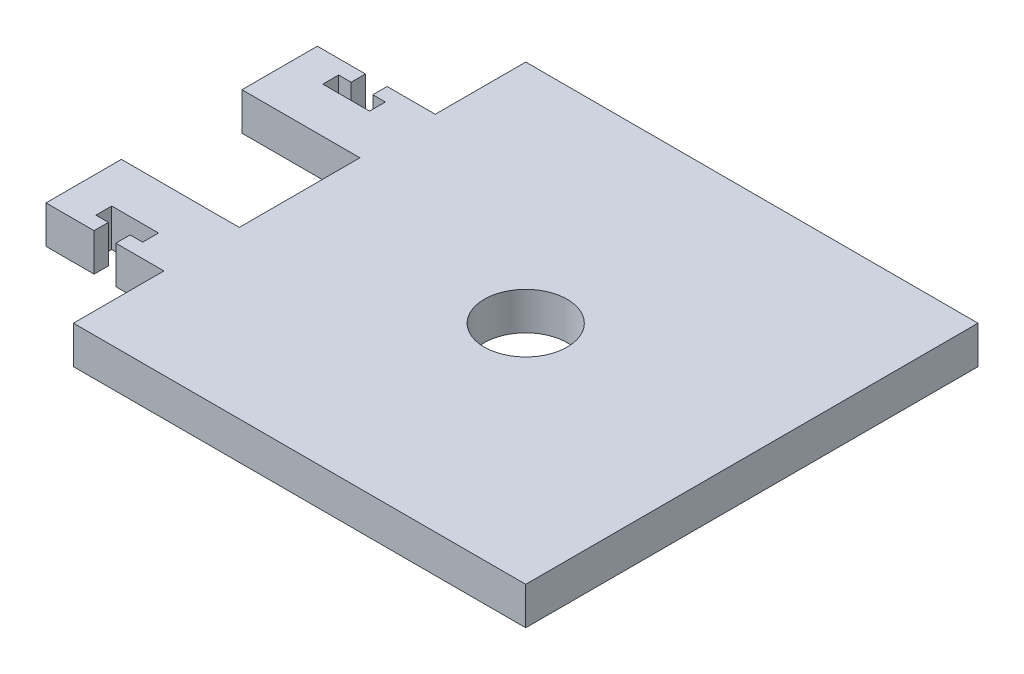
ISO-10303-21;
HEADER;
FILE_DESCRIPTION(('STEP AP214'),'2;1');
FILE_NAME('part.step','',(''),(''),'','','');
FILE_SCHEMA(('AUTOMOTIVE_DESIGN { 1 0 10303 214 1 1 1 1 }'));
ENDSEC;
DATA;
#1=APPLICATION_CONTEXT('core data for automotive mechanical design processes');
#2=APPLICATION_PROTOCOL_DEFINITION('international standard','automotive_design',2000,#1);
#3=PRODUCT_CONTEXT('',#1,'mechanical');
#4=PRODUCT('Part','Part','',(#3));
#5=PRODUCT_RELATED_PRODUCT_CATEGORY('part','',(#4));
#6=PRODUCT_DEFINITION_FORMATION('','',#4);
#7=PRODUCT_DEFINITION_CONTEXT('part definition',#1,'design');
#8=PRODUCT_DEFINITION('design','',#6,#7);
#9=PRODUCT_DEFINITION_SHAPE('','',#8);
#10=(LENGTH_UNIT() NAMED_UNIT(*) SI_UNIT(.MILLI.,.METRE.));
#11=(NAMED_UNIT(*) PLANE_ANGLE_UNIT() SI_UNIT($,.RADIAN.));
#12=(NAMED_UNIT(*) SI_UNIT($,.STERADIAN.) SOLID_ANGLE_UNIT());
#13=UNCERTAINTY_MEASURE_WITH_UNIT(LENGTH_MEASURE(1.E-05),#10,'distance_accuracy_value','');
#14=(GEOMETRIC_REPRESENTATION_CONTEXT(3) GLOBAL_UNCERTAINTY_ASSIGNED_CONTEXT((#13)) GLOBAL_UNIT_ASSIGNED_CONTEXT((#10,
#11,#12)) REPRESENTATION_CONTEXT('',''));
#15=CARTESIAN_POINT('',(0.,0.,0.));
#16=DIRECTION('',(0.,0.,1.));
#17=DIRECTION('',(1.,0.,0.));
#18=AXIS2_PLACEMENT_3D('',#15,#16,#17);
#19=CARTESIAN_POINT('',(38.1000000000002,-6.35,38.1000000000002));
#20=DIRECTION('',(1.,0.,0.));
#21=DIRECTION('',(0.,0.,-1.));
#22=AXIS2_PLACEMENT_3D('',#19,#20,#21);
#23=PLANE('',#22);
#24=DIRECTION('',(0.,0.,-1.));
#25=VECTOR('',#24,1.);
#26=CARTESIAN_POINT('',(38.1000000000002,0.,38.1000000000002));
#27=LINE('',#26,#25);
#28=CARTESIAN_POINT('',(38.1000000000002,0.,38.1000000000002));
#29=VERTEX_POINT('',#28);
#30=CARTESIAN_POINT('',(38.1000000000002,0.,-38.1000000000002));
#31=VERTEX_POINT('',#30);
#32=EDGE_CURVE('E250',#29,#31,#27,.T.);
#33=ORIENTED_EDGE('',*,*,#32,.F.);
#34=DIRECTION('',(0.,1.,0.));
#35=VECTOR('',#34,1.);
#36=CARTESIAN_POINT('',(38.1000000000002,-6.35,38.1000000000002));
#37=LINE('',#36,#35);
#38=CARTESIAN_POINT('',(38.1000000000002,-6.35,38.1000000000002));
#39=VERTEX_POINT('',#38);
#40=EDGE_CURVE('E11',#39,#29,#37,.T.);
#41=ORIENTED_EDGE('',*,*,#40,.F.);
#42=DIRECTION('',(0.,0.,-1.));
#43=VECTOR('',#42,1.);
#44=CARTESIAN_POINT('',(38.1000000000002,-6.35,38.1000000000002));
#45=LINE('',#44,#43);
#46=CARTESIAN_POINT('',(38.1000000000002,-6.35,-38.1000000000002));
#47=VERTEX_POINT('',#46);
#48=EDGE_CURVE('E331',#39,#47,#45,.T.);
#49=ORIENTED_EDGE('',*,*,#48,.T.);
#50=DIRECTION('',(0.,1.,0.));
#51=VECTOR('',#50,1.);
#52=CARTESIAN_POINT('',(38.1000000000002,-6.35,-38.1000000000002));
#53=LINE('',#52,#51);
#54=EDGE_CURVE('E36',#47,#31,#53,.T.);
#55=ORIENTED_EDGE('',*,*,#54,.T.);
#56=EDGE_LOOP('',(#33,#41,#49,#55));
#57=FACE_BOUND('',#56,.T.);
#58=ADVANCED_FACE('F33',(#57),#23,.T.);
#59=CARTESIAN_POINT('',(-38.0999999999998,-6.35,38.1000000000002));
#60=DIRECTION('',(0.,0.,1.));
#61=DIRECTION('',(1.,0.,0.));
#62=AXIS2_PLACEMENT_3D('',#59,#60,#61);
#63=PLANE('',#62);
#64=DIRECTION('',(1.,0.,0.));
#65=VECTOR('',#64,1.);
#66=CARTESIAN_POINT('',(-38.0999999999998,0.,38.1000000000002));
#67=LINE('',#66,#65);
#68=CARTESIAN_POINT('',(-38.0999999999998,0.,38.1000000000002));
#69=VERTEX_POINT('',#68);
#70=EDGE_CURVE('E329',#69,#29,#67,.T.);
#71=ORIENTED_EDGE('',*,*,#70,.F.);
#72=DIRECTION('',(0.,1.,0.));
#73=VECTOR('',#72,1.);
#74=CARTESIAN_POINT('',(-38.0999999999998,-6.35,38.1000000000002));
#75=LINE('',#74,#73);
#76=CARTESIAN_POINT('',(-38.0999999999998,-6.35,38.1000000000002));
#77=VERTEX_POINT('',#76);
#78=EDGE_CURVE('E42',#77,#69,#75,.T.);
#79=ORIENTED_EDGE('',*,*,#78,.F.);
#80=DIRECTION('',(1.,0.,0.));
#81=VECTOR('',#80,1.);
#82=CARTESIAN_POINT('',(-38.0999999999998,-6.35,38.1000000000002));
#83=LINE('',#82,#81);
#84=EDGE_CURVE('E240',#77,#39,#83,.T.);
#85=ORIENTED_EDGE('',*,*,#84,.T.);
#86=ORIENTED_EDGE('',*,*,#40,.T.);
#87=EDGE_LOOP('',(#71,#79,#85,#86));
#88=FACE_BOUND('',#87,.T.);
#89=ADVANCED_FACE('F383',(#88),#63,.T.);
#90=CARTESIAN_POINT('',(-38.0999999999998,-6.35,38.1000000000002));
#91=DIRECTION('',(-1.,0.,0.));
#92=DIRECTION('',(0.,0.,1.));
#93=AXIS2_PLACEMENT_3D('',#90,#91,#92);
#94=PLANE('',#93);
#95=DIRECTION('',(0.,0.,1.));
#96=VECTOR('',#95,1.);
#97=CARTESIAN_POINT('',(-38.0999999999998,0.,38.1000000000002));
#98=LINE('',#97,#96);
#99=CARTESIAN_POINT('',(-38.0999999999998,0.,22.8600000000002));
#100=VERTEX_POINT('',#99);
#101=EDGE_CURVE('E227',#100,#69,#98,.T.);
#102=ORIENTED_EDGE('',*,*,#101,.F.);
#103=DIRECTION('',(0.,1.,0.));
#104=VECTOR('',#103,1.);
#105=CARTESIAN_POINT('',(-38.0999999999998,-6.35,22.8600000000002));
#106=LINE('',#105,#104);
#107=CARTESIAN_POINT('',(-38.0999999999998,-6.35,22.8600000000002));
#108=VERTEX_POINT('',#107);
#109=EDGE_CURVE('E222',#108,#100,#106,.T.);
#110=ORIENTED_EDGE('',*,*,#109,.F.);
#111=DIRECTION('',(0.,0.,1.));
#112=VECTOR('',#111,1.);
#113=CARTESIAN_POINT('',(-38.0999999999998,-6.35,38.1000000000002));
#114=LINE('',#113,#112);
#115=EDGE_CURVE('E225',#108,#77,#114,.T.);
#116=ORIENTED_EDGE('',*,*,#115,.T.);
#117=ORIENTED_EDGE('',*,*,#78,.T.);
#118=EDGE_LOOP('',(#102,#110,#116,#117));
#119=FACE_BOUND('',#118,.T.);
#120=ADVANCED_FACE('F224',(#119),#94,.T.);
#121=CARTESIAN_POINT('',(-38.0999999999998,-6.35,22.8600000000002));
#122=DIRECTION('',(0.,0.,1.));
#123=DIRECTION('',(1.,0.,0.));
#124=AXIS2_PLACEMENT_3D('',#121,#122,#123);
#125=PLANE('',#124);
#126=DIRECTION('',(1.,0.,0.));
#127=VECTOR('',#126,1.);
#128=CARTESIAN_POINT('',(-38.0999999999998,0.,22.8600000000002));
#129=LINE('',#128,#127);
#130=CARTESIAN_POINT('',(-46.2025999999998,0.,22.8600000000002));
#131=VERTEX_POINT('',#130);
#132=EDGE_CURVE('E326',#131,#100,#129,.T.);
#133=ORIENTED_EDGE('',*,*,#132,.F.);
#134=DIRECTION('',(0.,1.,0.));
#135=VECTOR('',#134,1.);
#136=CARTESIAN_POINT('',(-46.2025999999998,-6.35,22.8600000000002));
#137=LINE('',#136,#135);
#138=CARTESIAN_POINT('',(-46.2025999999998,-6.35,22.8600000000002));
#139=VERTEX_POINT('',#138);
#140=EDGE_CURVE('E232',#139,#131,#137,.T.);
#141=ORIENTED_EDGE('',*,*,#140,.F.);
#142=DIRECTION('',(1.,0.,0.));
#143=VECTOR('',#142,1.);
#144=CARTESIAN_POINT('',(-38.0999999999998,-6.35,22.8600000000002));
#145=LINE('',#144,#143);
#146=EDGE_CURVE('E238',#139,#108,#145,.T.);
#147=ORIENTED_EDGE('',*,*,#146,.T.);
#148=ORIENTED_EDGE('',*,*,#109,.T.);
#149=EDGE_LOOP('',(#133,#141,#147,#148));
#150=FACE_BOUND('',#149,.T.);
#151=ADVANCED_FACE('F242',(#150),#125,.T.);
#152=CARTESIAN_POINT('',(-46.2025999999998,-6.35,22.8600000000002));
#153=DIRECTION('',(-1.,0.,0.));
#154=DIRECTION('',(0.,0.,1.));
#155=AXIS2_PLACEMENT_3D('',#152,#153,#154);
#156=PLANE('',#155);
#157=DIRECTION('',(0.,0.,1.));
#158=VECTOR('',#157,1.);
#159=CARTESIAN_POINT('',(-46.2025999999998,0.,22.8600000000002));
#160=LINE('',#159,#158);
#161=CARTESIAN_POINT('',(-46.2025999999998,0.,20.4470000000002));
#162=VERTEX_POINT('',#161);
#163=EDGE_CURVE('E323',#162,#131,#160,.T.);
#164=ORIENTED_EDGE('',*,*,#163,.F.);
#165=DIRECTION('',(0.,1.,0.));
#166=VECTOR('',#165,1.);
#167=CARTESIAN_POINT('',(-46.2025999999998,-6.35,20.4470000000002));
#168=LINE('',#167,#166);
#169=CARTESIAN_POINT('',(-46.2025999999998,-6.35,20.4470000000002));
#170=VERTEX_POINT('',#169);
#171=EDGE_CURVE('E335',#170,#162,#168,.T.);
#172=ORIENTED_EDGE('',*,*,#171,.F.);
#173=DIRECTION('',(0.,0.,1.));
#174=VECTOR('',#173,1.);
#175=CARTESIAN_POINT('',(-46.2025999999998,-6.35,22.8600000000002));
#176=LINE('',#175,#174);
#177=EDGE_CURVE('E243',#170,#139,#176,.T.);
#178=ORIENTED_EDGE('',*,*,#177,.T.);
#179=ORIENTED_EDGE('',*,*,#140,.T.);
#180=EDGE_LOOP('',(#164,#172,#178,#179));
#181=FACE_BOUND('',#180,.T.);
#182=ADVANCED_FACE('F396',(#181),#156,.T.);
#183=CARTESIAN_POINT('',(-46.2025999999998,-6.35,20.4470000000002));
#184=DIRECTION('',(0.,0.,-1.));
#185=DIRECTION('',(-1.,0.,0.));
#186=AXIS2_PLACEMENT_3D('',#183,#184,#185);
#187=PLANE('',#186);
#188=DIRECTION('',(-1.,0.,0.));
#189=VECTOR('',#188,1.);
#190=CARTESIAN_POINT('',(-46.2025999999998,0.,20.4470000000002));
#191=LINE('',#190,#189);
#192=CARTESIAN_POINT('',(-44.0943999999998,0.,20.4470000000002));
#193=VERTEX_POINT('',#192);
#194=EDGE_CURVE('E320',#193,#162,#191,.T.);
#195=ORIENTED_EDGE('',*,*,#194,.F.);
#196=DIRECTION('',(0.,1.,0.));
#197=VECTOR('',#196,1.);
#198=CARTESIAN_POINT('',(-44.0943999999998,-6.35,20.4470000000002));
#199=LINE('',#198,#197);
#200=CARTESIAN_POINT('',(-44.0943999999998,-6.35,20.4470000000002));
#201=VERTEX_POINT('',#200);
#202=EDGE_CURVE('E337',#201,#193,#199,.T.);
#203=ORIENTED_EDGE('',*,*,#202,.F.);
#204=DIRECTION('',(-1.,0.,0.));
#205=VECTOR('',#204,1.);
#206=CARTESIAN_POINT('',(-46.2025999999998,-6.35,20.4470000000002));
#207=LINE('',#206,#205);
#208=EDGE_CURVE('E245',#201,#170,#207,.T.);
#209=ORIENTED_EDGE('',*,*,#208,.T.);
#210=ORIENTED_EDGE('',*,*,#171,.T.);
#211=EDGE_LOOP('',(#195,#203,#209,#210));
#212=FACE_BOUND('',#211,.T.);
#213=ADVANCED_FACE('F399',(#212),#187,.T.);
#214=CARTESIAN_POINT('',(-44.0943999999998,-6.35,20.4470000000002));
#215=DIRECTION('',(-1.,0.,0.));
#216=DIRECTION('',(0.,0.,1.));
#217=AXIS2_PLACEMENT_3D('',#214,#215,#216);
#218=PLANE('',#217);
#219=DIRECTION('',(0.,0.,1.));
#220=VECTOR('',#219,1.);
#221=CARTESIAN_POINT('',(-44.0943999999998,0.,20.4470000000002));
#222=LINE('',#221,#220);
#223=CARTESIAN_POINT('',(-44.0943999999998,0.,17.7800000000002));
#224=VERTEX_POINT('',#223);
#225=EDGE_CURVE('E317',#224,#193,#222,.T.);
#226=ORIENTED_EDGE('',*,*,#225,.F.);
#227=DIRECTION('',(0.,1.,0.));
#228=VECTOR('',#227,1.);
#229=CARTESIAN_POINT('',(-44.0943999999998,-6.35,17.7800000000002));
#230=LINE('',#229,#228);
#231=CARTESIAN_POINT('',(-44.0943999999998,-6.35,17.7800000000002));
#232=VERTEX_POINT('',#231);
#233=EDGE_CURVE('E339',#232,#224,#230,.T.);
#234=ORIENTED_EDGE('',*,*,#233,.F.);
#235=DIRECTION('',(0.,0.,1.));
#236=VECTOR('',#235,1.);
#237=CARTESIAN_POINT('',(-44.0943999999998,-6.35,20.4470000000002));
#238=LINE('',#237,#236);
#239=EDGE_CURVE('E574',#232,#201,#238,.T.);
#240=ORIENTED_EDGE('',*,*,#239,.T.);
#241=ORIENTED_EDGE('',*,*,#202,.T.);
#242=EDGE_LOOP('',(#226,#234,#240,#241));
#243=FACE_BOUND('',#242,.T.);
#244=ADVANCED_FACE('F403',(#243),#218,.T.);
#245=CARTESIAN_POINT('',(-44.0943999999998,-6.35,17.7800000000002));
#246=DIRECTION('',(0.,0.,1.));
#247=DIRECTION('',(1.,0.,0.));
#248=AXIS2_PLACEMENT_3D('',#245,#246,#247);
#249=PLANE('',#248);
#250=DIRECTION('',(1.,0.,0.));
#251=VECTOR('',#250,1.);
#252=CARTESIAN_POINT('',(-44.0943999999998,0.,17.7800000000002));
#253=LINE('',#252,#251);
#254=CARTESIAN_POINT('',(-51.9683999999998,0.,17.7800000000002));
#255=VERTEX_POINT('',#254);
#256=EDGE_CURVE('E314',#255,#224,#253,.T.);
#257=ORIENTED_EDGE('',*,*,#256,.F.);
#258=DIRECTION('',(0.,1.,0.));
#259=VECTOR('',#258,1.);
#260=CARTESIAN_POINT('',(-51.9683999999998,-6.35,17.7800000000002));
#261=LINE('',#260,#259);
#262=CARTESIAN_POINT('',(-51.9683999999998,-6.35,17.7800000000002));
#263=VERTEX_POINT('',#262);
#264=EDGE_CURVE('E341',#263,#255,#261,.T.);
#265=ORIENTED_EDGE('',*,*,#264,.F.);
#266=DIRECTION('',(1.,0.,0.));
#267=VECTOR('',#266,1.);
#268=CARTESIAN_POINT('',(-44.0943999999998,-6.35,17.7800000000002));
#269=LINE('',#268,#267);
#270=EDGE_CURVE('E571',#263,#232,#269,.T.);
#271=ORIENTED_EDGE('',*,*,#270,.T.);
#272=ORIENTED_EDGE('',*,*,#233,.T.);
#273=EDGE_LOOP('',(#257,#265,#271,#272));
#274=FACE_BOUND('',#273,.T.);
#275=ADVANCED_FACE('F407',(#274),#249,.T.);
#276=CARTESIAN_POINT('',(-51.9683999999998,-6.35,20.4470000000002));
#277=DIRECTION('',(1.,0.,0.));
#278=DIRECTION('',(0.,0.,-1.));
#279=AXIS2_PLACEMENT_3D('',#276,#277,#278);
#280=PLANE('',#279);
#281=DIRECTION('',(0.,0.,-1.));
#282=VECTOR('',#281,1.);
#283=CARTESIAN_POINT('',(-51.9683999999998,0.,20.4470000000002));
#284=LINE('',#283,#282);
#285=CARTESIAN_POINT('',(-51.9683999999998,0.,20.4470000000002));
#286=VERTEX_POINT('',#285);
#287=EDGE_CURVE('E311',#286,#255,#284,.T.);
#288=ORIENTED_EDGE('',*,*,#287,.F.);
#289=DIRECTION('',(0.,1.,0.));
#290=VECTOR('',#289,1.);
#291=CARTESIAN_POINT('',(-51.9683999999998,-6.35,20.4470000000002));
#292=LINE('',#291,#290);
#293=CARTESIAN_POINT('',(-51.9683999999998,-6.35,20.4470000000002));
#294=VERTEX_POINT('',#293);
#295=EDGE_CURVE('E343',#294,#286,#292,.T.);
#296=ORIENTED_EDGE('',*,*,#295,.F.);
#297=DIRECTION('',(0.,0.,-1.));
#298=VECTOR('',#297,1.);
#299=CARTESIAN_POINT('',(-51.9683999999998,-6.35,20.4470000000002));
#300=LINE('',#299,#298);
#301=EDGE_CURVE('E568',#294,#263,#300,.T.);
#302=ORIENTED_EDGE('',*,*,#301,.T.);
#303=ORIENTED_EDGE('',*,*,#264,.T.);
#304=EDGE_LOOP('',(#288,#296,#302,#303));
#305=FACE_BOUND('',#304,.T.);
#306=ADVANCED_FACE('F411',(#305),#280,.T.);
#307=CARTESIAN_POINT('',(-49.8601999999998,-6.35,20.4470000000002));
#308=DIRECTION('',(0.,0.,-1.));
#309=DIRECTION('',(-1.,0.,0.));
#310=AXIS2_PLACEMENT_3D('',#307,#308,#309);
#311=PLANE('',#310);
#312=DIRECTION('',(-1.,0.,0.));
#313=VECTOR('',#312,1.);
#314=CARTESIAN_POINT('',(-49.8601999999998,0.,20.4470000000002));
#315=LINE('',#314,#313);
#316=CARTESIAN_POINT('',(-49.8601999999998,0.,20.4470000000002));
#317=VERTEX_POINT('',#316);
#318=EDGE_CURVE('E308',#317,#286,#315,.T.);
#319=ORIENTED_EDGE('',*,*,#318,.F.);
#320=DIRECTION('',(0.,1.,0.));
#321=VECTOR('',#320,1.);
#322=CARTESIAN_POINT('',(-49.8601999999998,-6.35,20.4470000000002));
#323=LINE('',#322,#321);
#324=CARTESIAN_POINT('',(-49.8601999999998,-6.35,20.4470000000002));
#325=VERTEX_POINT('',#324);
#326=EDGE_CURVE('E345',#325,#317,#323,.T.);
#327=ORIENTED_EDGE('',*,*,#326,.F.);
#328=DIRECTION('',(-1.,0.,0.));
#329=VECTOR('',#328,1.);
#330=CARTESIAN_POINT('',(-49.8601999999998,-6.35,20.4470000000002));
#331=LINE('',#330,#329);
#332=EDGE_CURVE('E565',#325,#294,#331,.T.);
#333=ORIENTED_EDGE('',*,*,#332,.T.);
#334=ORIENTED_EDGE('',*,*,#295,.T.);
#335=EDGE_LOOP('',(#319,#327,#333,#334));
#336=FACE_BOUND('',#335,.T.);
#337=ADVANCED_FACE('F415',(#336),#311,.T.);
#338=CARTESIAN_POINT('',(-49.8601999999998,-6.35,22.8600000000002));
#339=DIRECTION('',(1.,0.,0.));
#340=DIRECTION('',(0.,0.,-1.));
#341=AXIS2_PLACEMENT_3D('',#338,#339,#340);
#342=PLANE('',#341);
#343=DIRECTION('',(0.,0.,-1.));
#344=VECTOR('',#343,1.);
#345=CARTESIAN_POINT('',(-49.8601999999998,0.,22.8600000000002));
#346=LINE('',#345,#344);
#347=CARTESIAN_POINT('',(-49.8601999999998,0.,22.8600000000002));
#348=VERTEX_POINT('',#347);
#349=EDGE_CURVE('E305',#348,#317,#346,.T.);
#350=ORIENTED_EDGE('',*,*,#349,.F.);
#351=DIRECTION('',(0.,1.,0.));
#352=VECTOR('',#351,1.);
#353=CARTESIAN_POINT('',(-49.8601999999998,-6.35,22.8600000000002));
#354=LINE('',#353,#352);
#355=CARTESIAN_POINT('',(-49.8601999999998,-6.35,22.8600000000002));
#356=VERTEX_POINT('',#355);
#357=EDGE_CURVE('E347',#356,#348,#354,.T.);
#358=ORIENTED_EDGE('',*,*,#357,.F.);
#359=DIRECTION('',(0.,0.,-1.));
#360=VECTOR('',#359,1.);
#361=CARTESIAN_POINT('',(-49.8601999999998,-6.35,22.8600000000002));
#362=LINE('',#361,#360);
#363=EDGE_CURVE('E562',#356,#325,#362,.T.);
#364=ORIENTED_EDGE('',*,*,#363,.T.);
#365=ORIENTED_EDGE('',*,*,#326,.T.);
#366=EDGE_LOOP('',(#350,#358,#364,#365));
#367=FACE_BOUND('',#366,.T.);
#368=ADVANCED_FACE('F419',(#367),#342,.T.);
#369=CARTESIAN_POINT('',(-49.8601999999998,-6.35,22.8600000000002));
#370=DIRECTION('',(0.,0.,1.));
#371=DIRECTION('',(1.,0.,0.));
#372=AXIS2_PLACEMENT_3D('',#369,#370,#371);
#373=PLANE('',#372);
#374=DIRECTION('',(1.,0.,0.));
#375=VECTOR('',#374,1.);
#376=CARTESIAN_POINT('',(-49.8601999999998,0.,22.8600000000002));
#377=LINE('',#376,#375);
#378=CARTESIAN_POINT('',(-57.9627999999998,0.,22.8600000000002));
#379=VERTEX_POINT('',#378);
#380=EDGE_CURVE('E302',#379,#348,#377,.T.);
#381=ORIENTED_EDGE('',*,*,#380,.F.);
#382=DIRECTION('',(0.,1.,0.));
#383=VECTOR('',#382,1.);
#384=CARTESIAN_POINT('',(-57.9627999999998,-6.35,22.8600000000002));
#385=LINE('',#384,#383);
#386=CARTESIAN_POINT('',(-57.9627999999998,-6.35,22.8600000000002));
#387=VERTEX_POINT('',#386);
#388=EDGE_CURVE('E349',#387,#379,#385,.T.);
#389=ORIENTED_EDGE('',*,*,#388,.F.);
#390=DIRECTION('',(1.,0.,0.));
#391=VECTOR('',#390,1.);
#392=CARTESIAN_POINT('',(-49.8601999999998,-6.35,22.8600000000002));
#393=LINE('',#392,#391);
#394=EDGE_CURVE('E559',#387,#356,#393,.T.);
#395=ORIENTED_EDGE('',*,*,#394,.T.);
#396=ORIENTED_EDGE('',*,*,#357,.T.);
#397=EDGE_LOOP('',(#381,#389,#395,#396));
#398=FACE_BOUND('',#397,.T.);
#399=ADVANCED_FACE('F423',(#398),#373,.T.);
#400=CARTESIAN_POINT('',(-57.9627999999998,-6.35,22.8600000000002));
#401=DIRECTION('',(-1.,0.,0.));
#402=DIRECTION('',(0.,0.,1.));
#403=AXIS2_PLACEMENT_3D('',#400,#401,#402);
#404=PLANE('',#403);
#405=DIRECTION('',(0.,0.,1.));
#406=VECTOR('',#405,1.);
#407=CARTESIAN_POINT('',(-57.9627999999998,0.,22.8600000000002));
#408=LINE('',#407,#406);
#409=CARTESIAN_POINT('',(-57.9627999999998,0.,10.16));
#410=VERTEX_POINT('',#409);
#411=EDGE_CURVE('E299',#410,#379,#408,.T.);
#412=ORIENTED_EDGE('',*,*,#411,.F.);
#413=DIRECTION('',(0.,1.,0.));
#414=VECTOR('',#413,1.);
#415=CARTESIAN_POINT('',(-57.9627999999998,-6.35,10.16));
#416=LINE('',#415,#414);
#417=CARTESIAN_POINT('',(-57.9627999999998,-6.35,10.16));
#418=VERTEX_POINT('',#417);
#419=EDGE_CURVE('E351',#418,#410,#416,.T.);
#420=ORIENTED_EDGE('',*,*,#419,.F.);
#421=DIRECTION('',(0.,0.,1.));
#422=VECTOR('',#421,1.);
#423=CARTESIAN_POINT('',(-57.9627999999998,-6.35,22.8600000000002));
#424=LINE('',#423,#422);
#425=EDGE_CURVE('E556',#418,#387,#424,.T.);
#426=ORIENTED_EDGE('',*,*,#425,.T.);
#427=ORIENTED_EDGE('',*,*,#388,.T.);
#428=EDGE_LOOP('',(#412,#420,#426,#427));
#429=FACE_BOUND('',#428,.T.);
#430=ADVANCED_FACE('F427',(#429),#404,.T.);
#431=CARTESIAN_POINT('',(-57.9627999999998,-6.35,10.16));
#432=DIRECTION('',(0.,0.,-1.));
#433=DIRECTION('',(-1.,0.,0.));
#434=AXIS2_PLACEMENT_3D('',#431,#432,#433);
#435=PLANE('',#434);
#436=DIRECTION('',(-1.,0.,0.));
#437=VECTOR('',#436,1.);
#438=CARTESIAN_POINT('',(-57.9627999999998,0.,10.16));
#439=LINE('',#438,#437);
#440=CARTESIAN_POINT('',(-38.0999999999998,0.,10.16));
#441=VERTEX_POINT('',#440);
#442=EDGE_CURVE('E296',#441,#410,#439,.T.);
#443=ORIENTED_EDGE('',*,*,#442,.F.);
#444=DIRECTION('',(0.,1.,0.));
#445=VECTOR('',#444,1.);
#446=CARTESIAN_POINT('',(-38.0999999999998,-6.35,10.16));
#447=LINE('',#446,#445);
#448=CARTESIAN_POINT('',(-38.0999999999998,-6.35,10.16));
#449=VERTEX_POINT('',#448);
#450=EDGE_CURVE('E353',#449,#441,#447,.T.);
#451=ORIENTED_EDGE('',*,*,#450,.F.);
#452=DIRECTION('',(-1.,0.,0.));
#453=VECTOR('',#452,1.);
#454=CARTESIAN_POINT('',(-57.9627999999998,-6.35,10.16));
#455=LINE('',#454,#453);
#456=EDGE_CURVE('E553',#449,#418,#455,.T.);
#457=ORIENTED_EDGE('',*,*,#456,.T.);
#458=ORIENTED_EDGE('',*,*,#419,.T.);
#459=EDGE_LOOP('',(#443,#451,#457,#458));
#460=FACE_BOUND('',#459,.T.);
#461=ADVANCED_FACE('F431',(#460),#435,.T.);
#462=CARTESIAN_POINT('',(-38.0999999999998,-6.35,10.16));
#463=DIRECTION('',(-1.,0.,0.));
#464=DIRECTION('',(0.,0.,1.));
#465=AXIS2_PLACEMENT_3D('',#462,#463,#464);
#466=PLANE('',#465);
#467=DIRECTION('',(0.,0.,1.));
#468=VECTOR('',#467,1.);
#469=CARTESIAN_POINT('',(-38.0999999999998,0.,10.16));
#470=LINE('',#469,#468);
#471=CARTESIAN_POINT('',(-38.0999999999998,0.,-10.16));
#472=VERTEX_POINT('',#471);
#473=EDGE_CURVE('E293',#472,#441,#470,.T.);
#474=ORIENTED_EDGE('',*,*,#473,.F.);
#475=DIRECTION('',(0.,1.,0.));
#476=VECTOR('',#475,1.);
#477=CARTESIAN_POINT('',(-38.0999999999998,-6.35,-10.16));
#478=LINE('',#477,#476);
#479=CARTESIAN_POINT('',(-38.0999999999998,-6.35,-10.16));
#480=VERTEX_POINT('',#479);
#481=EDGE_CURVE('E355',#480,#472,#478,.T.);
#482=ORIENTED_EDGE('',*,*,#481,.F.);
#483=DIRECTION('',(0.,0.,1.));
#484=VECTOR('',#483,1.);
#485=CARTESIAN_POINT('',(-38.0999999999998,-6.35,10.16));
#486=LINE('',#485,#484);
#487=EDGE_CURVE('E550',#480,#449,#486,.T.);
#488=ORIENTED_EDGE('',*,*,#487,.T.);
#489=ORIENTED_EDGE('',*,*,#450,.T.);
#490=EDGE_LOOP('',(#474,#482,#488,#489));
#491=FACE_BOUND('',#490,.T.);
#492=ADVANCED_FACE('F435',(#491),#466,.T.);
#493=CARTESIAN_POINT('',(-57.9627999999998,-6.35,-10.16));
#494=DIRECTION('',(0.,0.,1.));
#495=DIRECTION('',(1.,0.,0.));
#496=AXIS2_PLACEMENT_3D('',#493,#494,#495);
#497=PLANE('',#496);
#498=DIRECTION('',(1.,0.,0.));
#499=VECTOR('',#498,1.);
#500=CARTESIAN_POINT('',(-57.9627999999998,0.,-10.16));
#501=LINE('',#500,#499);
#502=CARTESIAN_POINT('',(-57.9627999999998,0.,-10.16));
#503=VERTEX_POINT('',#502);
#504=EDGE_CURVE('E290',#503,#472,#501,.T.);
#505=ORIENTED_EDGE('',*,*,#504,.F.);
#506=DIRECTION('',(0.,1.,0.));
#507=VECTOR('',#506,1.);
#508=CARTESIAN_POINT('',(-57.9627999999998,-6.35,-10.16));
#509=LINE('',#508,#507);
#510=CARTESIAN_POINT('',(-57.9627999999998,-6.35,-10.16));
#511=VERTEX_POINT('',#510);
#512=EDGE_CURVE('E357',#511,#503,#509,.T.);
#513=ORIENTED_EDGE('',*,*,#512,.F.);
#514=DIRECTION('',(1.,0.,0.));
#515=VECTOR('',#514,1.);
#516=CARTESIAN_POINT('',(-57.9627999999998,-6.35,-10.16));
#517=LINE('',#516,#515);
#518=EDGE_CURVE('E547',#511,#480,#517,.T.);
#519=ORIENTED_EDGE('',*,*,#518,.T.);
#520=ORIENTED_EDGE('',*,*,#481,.T.);
#521=EDGE_LOOP('',(#505,#513,#519,#520));
#522=FACE_BOUND('',#521,.T.);
#523=ADVANCED_FACE('F439',(#522),#497,.T.);
#524=CARTESIAN_POINT('',(-57.9627999999998,-6.35,-22.8600000000002));
#525=DIRECTION('',(-1.,0.,0.));
#526=DIRECTION('',(0.,0.,1.));
#527=AXIS2_PLACEMENT_3D('',#524,#525,#526);
#528=PLANE('',#527);
#529=DIRECTION('',(0.,0.,1.));
#530=VECTOR('',#529,1.);
#531=CARTESIAN_POINT('',(-57.9627999999998,0.,-22.8600000000002));
#532=LINE('',#531,#530);
#533=CARTESIAN_POINT('',(-57.9627999999998,0.,-22.8600000000002));
#534=VERTEX_POINT('',#533);
#535=EDGE_CURVE('E287',#534,#503,#532,.T.);
#536=ORIENTED_EDGE('',*,*,#535,.F.);
#537=DIRECTION('',(0.,1.,0.));
#538=VECTOR('',#537,1.);
#539=CARTESIAN_POINT('',(-57.9627999999998,-6.35,-22.8600000000002));
#540=LINE('',#539,#538);
#541=CARTESIAN_POINT('',(-57.9627999999998,-6.35,-22.8600000000002));
#542=VERTEX_POINT('',#541);
#543=EDGE_CURVE('E359',#542,#534,#540,.T.);
#544=ORIENTED_EDGE('',*,*,#543,.F.);
#545=DIRECTION('',(0.,0.,1.));
#546=VECTOR('',#545,1.);
#547=CARTESIAN_POINT('',(-57.9627999999998,-6.35,-22.8600000000002));
#548=LINE('',#547,#546);
#549=EDGE_CURVE('E544',#542,#511,#548,.T.);
#550=ORIENTED_EDGE('',*,*,#549,.T.);
#551=ORIENTED_EDGE('',*,*,#512,.T.);
#552=EDGE_LOOP('',(#536,#544,#550,#551));
#553=FACE_BOUND('',#552,.T.);
#554=ADVANCED_FACE('F443',(#553),#528,.T.);
#555=CARTESIAN_POINT('',(-49.8601999999998,-6.35,-22.8600000000002));
#556=DIRECTION('',(0.,0.,-1.));
#557=DIRECTION('',(-1.,0.,0.));
#558=AXIS2_PLACEMENT_3D('',#555,#556,#557);
#559=PLANE('',#558);
#560=DIRECTION('',(-1.,0.,0.));
#561=VECTOR('',#560,1.);
#562=CARTESIAN_POINT('',(-49.8601999999998,0.,-22.8600000000002));
#563=LINE('',#562,#561);
#564=CARTESIAN_POINT('',(-49.8601999999998,0.,-22.8600000000002));
#565=VERTEX_POINT('',#564);
#566=EDGE_CURVE('E284',#565,#534,#563,.T.);
#567=ORIENTED_EDGE('',*,*,#566,.F.);
#568=DIRECTION('',(0.,1.,0.));
#569=VECTOR('',#568,1.);
#570=CARTESIAN_POINT('',(-49.8601999999998,-6.35,-22.8600000000002));
#571=LINE('',#570,#569);
#572=CARTESIAN_POINT('',(-49.8601999999998,-6.35,-22.8600000000002));
#573=VERTEX_POINT('',#572);
#574=EDGE_CURVE('E361',#573,#565,#571,.T.);
#575=ORIENTED_EDGE('',*,*,#574,.F.);
#576=DIRECTION('',(-1.,0.,0.));
#577=VECTOR('',#576,1.);
#578=CARTESIAN_POINT('',(-49.8601999999998,-6.35,-22.8600000000002));
#579=LINE('',#578,#577);
#580=EDGE_CURVE('E541',#573,#542,#579,.T.);
#581=ORIENTED_EDGE('',*,*,#580,.T.);
#582=ORIENTED_EDGE('',*,*,#543,.T.);
#583=EDGE_LOOP('',(#567,#575,#581,#582));
#584=FACE_BOUND('',#583,.T.);
#585=ADVANCED_FACE('F447',(#584),#559,.T.);
#586=CARTESIAN_POINT('',(-49.8601999999998,-6.35,-22.8600000000002));
#587=DIRECTION('',(1.,0.,0.));
#588=DIRECTION('',(0.,0.,-1.));
#589=AXIS2_PLACEMENT_3D('',#586,#587,#588);
#590=PLANE('',#589);
#591=DIRECTION('',(0.,0.,-1.));
#592=VECTOR('',#591,1.);
#593=CARTESIAN_POINT('',(-49.8601999999998,0.,-22.8600000000002));
#594=LINE('',#593,#592);
#595=CARTESIAN_POINT('',(-49.8601999999998,0.,-20.4470000000002));
#596=VERTEX_POINT('',#595);
#597=EDGE_CURVE('E281',#596,#565,#594,.T.);
#598=ORIENTED_EDGE('',*,*,#597,.F.);
#599=DIRECTION('',(0.,1.,0.));
#600=VECTOR('',#599,1.);
#601=CARTESIAN_POINT('',(-49.8601999999998,-6.35,-20.4470000000002));
#602=LINE('',#601,#600);
#603=CARTESIAN_POINT('',(-49.8601999999998,-6.35,-20.4470000000002));
#604=VERTEX_POINT('',#603);
#605=EDGE_CURVE('E363',#604,#596,#602,.T.);
#606=ORIENTED_EDGE('',*,*,#605,.F.);
#607=DIRECTION('',(0.,0.,-1.));
#608=VECTOR('',#607,1.);
#609=CARTESIAN_POINT('',(-49.8601999999998,-6.35,-22.8600000000002));
#610=LINE('',#609,#608);
#611=EDGE_CURVE('E538',#604,#573,#610,.T.);
#612=ORIENTED_EDGE('',*,*,#611,.T.);
#613=ORIENTED_EDGE('',*,*,#574,.T.);
#614=EDGE_LOOP('',(#598,#606,#612,#613));
#615=FACE_BOUND('',#614,.T.);
#616=ADVANCED_FACE('F451',(#615),#590,.T.);
#617=CARTESIAN_POINT('',(-49.8601999999998,-6.35,-20.4470000000002));
#618=DIRECTION('',(0.,0.,1.));
#619=DIRECTION('',(1.,0.,0.));
#620=AXIS2_PLACEMENT_3D('',#617,#618,#619);
#621=PLANE('',#620);
#622=DIRECTION('',(1.,0.,0.));
#623=VECTOR('',#622,1.);
#624=CARTESIAN_POINT('',(-49.8601999999998,0.,-20.4470000000002));
#625=LINE('',#624,#623);
#626=CARTESIAN_POINT('',(-51.9683999999998,0.,-20.4470000000002));
#627=VERTEX_POINT('',#626);
#628=EDGE_CURVE('E278',#627,#596,#625,.T.);
#629=ORIENTED_EDGE('',*,*,#628,.F.);
#630=DIRECTION('',(0.,1.,0.));
#631=VECTOR('',#630,1.);
#632=CARTESIAN_POINT('',(-51.9683999999998,-6.35,-20.4470000000002));
#633=LINE('',#632,#631);
#634=CARTESIAN_POINT('',(-51.9683999999998,-6.35,-20.4470000000002));
#635=VERTEX_POINT('',#634);
#636=EDGE_CURVE('E365',#635,#627,#633,.T.);
#637=ORIENTED_EDGE('',*,*,#636,.F.);
#638=DIRECTION('',(1.,0.,0.));
#639=VECTOR('',#638,1.);
#640=CARTESIAN_POINT('',(-49.8601999999998,-6.35,-20.4470000000002));
#641=LINE('',#640,#639);
#642=EDGE_CURVE('E535',#635,#604,#641,.T.);
#643=ORIENTED_EDGE('',*,*,#642,.T.);
#644=ORIENTED_EDGE('',*,*,#605,.T.);
#645=EDGE_LOOP('',(#629,#637,#643,#644));
#646=FACE_BOUND('',#645,.T.);
#647=ADVANCED_FACE('F455',(#646),#621,.T.);
#648=CARTESIAN_POINT('',(-51.9683999999998,-6.35,-20.4470000000002));
#649=DIRECTION('',(1.,0.,0.));
#650=DIRECTION('',(0.,0.,-1.));
#651=AXIS2_PLACEMENT_3D('',#648,#649,#650);
#652=PLANE('',#651);
#653=DIRECTION('',(0.,0.,-1.));
#654=VECTOR('',#653,1.);
#655=CARTESIAN_POINT('',(-51.9683999999998,0.,-20.4470000000002));
#656=LINE('',#655,#654);
#657=CARTESIAN_POINT('',(-51.9683999999998,0.,-17.7800000000002));
#658=VERTEX_POINT('',#657);
#659=EDGE_CURVE('E275',#658,#627,#656,.T.);
#660=ORIENTED_EDGE('',*,*,#659,.F.);
#661=DIRECTION('',(0.,1.,0.));
#662=VECTOR('',#661,1.);
#663=CARTESIAN_POINT('',(-51.9683999999998,-6.35,-17.7800000000002));
#664=LINE('',#663,#662);
#665=CARTESIAN_POINT('',(-51.9683999999998,-6.35,-17.7800000000002));
#666=VERTEX_POINT('',#665);
#667=EDGE_CURVE('E367',#666,#658,#664,.T.);
#668=ORIENTED_EDGE('',*,*,#667,.F.);
#669=DIRECTION('',(0.,0.,-1.));
#670=VECTOR('',#669,1.);
#671=CARTESIAN_POINT('',(-51.9683999999998,-6.35,-20.4470000000002));
#672=LINE('',#671,#670);
#673=EDGE_CURVE('E532',#666,#635,#672,.T.);
#674=ORIENTED_EDGE('',*,*,#673,.T.);
#675=ORIENTED_EDGE('',*,*,#636,.T.);
#676=EDGE_LOOP('',(#660,#668,#674,#675));
#677=FACE_BOUND('',#676,.T.);
#678=ADVANCED_FACE('F459',(#677),#652,.T.);
#679=CARTESIAN_POINT('',(-44.0943999999998,-6.35,-17.7800000000002));
#680=DIRECTION('',(0.,0.,-1.));
#681=DIRECTION('',(-1.,0.,0.));
#682=AXIS2_PLACEMENT_3D('',#679,#680,#681);
#683=PLANE('',#682);
#684=DIRECTION('',(-1.,0.,0.));
#685=VECTOR('',#684,1.);
#686=CARTESIAN_POINT('',(-44.0943999999998,0.,-17.7800000000002));
#687=LINE('',#686,#685);
#688=CARTESIAN_POINT('',(-44.0943999999998,0.,-17.7800000000002));
#689=VERTEX_POINT('',#688);
#690=EDGE_CURVE('E272',#689,#658,#687,.T.);
#691=ORIENTED_EDGE('',*,*,#690,.F.);
#692=DIRECTION('',(0.,1.,0.));
#693=VECTOR('',#692,1.);
#694=CARTESIAN_POINT('',(-44.0943999999998,-6.35,-17.7800000000002));
#695=LINE('',#694,#693);
#696=CARTESIAN_POINT('',(-44.0943999999998,-6.35,-17.7800000000002));
#697=VERTEX_POINT('',#696);
#698=EDGE_CURVE('E369',#697,#689,#695,.T.);
#699=ORIENTED_EDGE('',*,*,#698,.F.);
#700=DIRECTION('',(-1.,0.,0.));
#701=VECTOR('',#700,1.);
#702=CARTESIAN_POINT('',(-44.0943999999998,-6.35,-17.7800000000002));
#703=LINE('',#702,#701);
#704=EDGE_CURVE('E529',#697,#666,#703,.T.);
#705=ORIENTED_EDGE('',*,*,#704,.T.);
#706=ORIENTED_EDGE('',*,*,#667,.T.);
#707=EDGE_LOOP('',(#691,#699,#705,#706));
#708=FACE_BOUND('',#707,.T.);
#709=ADVANCED_FACE('F463',(#708),#683,.T.);
#710=CARTESIAN_POINT('',(-44.0943999999998,-6.35,-20.4470000000002));
#711=DIRECTION('',(-1.,0.,0.));
#712=DIRECTION('',(0.,0.,1.));
#713=AXIS2_PLACEMENT_3D('',#710,#711,#712);
#714=PLANE('',#713);
#715=DIRECTION('',(0.,0.,1.));
#716=VECTOR('',#715,1.);
#717=CARTESIAN_POINT('',(-44.0943999999998,0.,-20.4470000000002));
#718=LINE('',#717,#716);
#719=CARTESIAN_POINT('',(-44.0943999999998,0.,-20.4470000000002));
#720=VERTEX_POINT('',#719);
#721=EDGE_CURVE('E269',#720,#689,#718,.T.);
#722=ORIENTED_EDGE('',*,*,#721,.F.);
#723=DIRECTION('',(0.,1.,0.));
#724=VECTOR('',#723,1.);
#725=CARTESIAN_POINT('',(-44.0943999999998,-6.35,-20.4470000000002));
#726=LINE('',#725,#724);
#727=CARTESIAN_POINT('',(-44.0943999999998,-6.35,-20.4470000000002));
#728=VERTEX_POINT('',#727);
#729=EDGE_CURVE('E371',#728,#720,#726,.T.);
#730=ORIENTED_EDGE('',*,*,#729,.F.);
#731=DIRECTION('',(0.,0.,1.));
#732=VECTOR('',#731,1.);
#733=CARTESIAN_POINT('',(-44.0943999999998,-6.35,-20.4470000000002));
#734=LINE('',#733,#732);
#735=EDGE_CURVE('E526',#728,#697,#734,.T.);
#736=ORIENTED_EDGE('',*,*,#735,.T.);
#737=ORIENTED_EDGE('',*,*,#698,.T.);
#738=EDGE_LOOP('',(#722,#730,#736,#737));
#739=FACE_BOUND('',#738,.T.);
#740=ADVANCED_FACE('F467',(#739),#714,.T.);
#741=CARTESIAN_POINT('',(-46.2025999999998,-6.35,-20.4470000000002));
#742=DIRECTION('',(0.,0.,1.));
#743=DIRECTION('',(1.,0.,0.));
#744=AXIS2_PLACEMENT_3D('',#741,#742,#743);
#745=PLANE('',#744);
#746=DIRECTION('',(1.,0.,0.));
#747=VECTOR('',#746,1.);
#748=CARTESIAN_POINT('',(-46.2025999999998,0.,-20.4470000000002));
#749=LINE('',#748,#747);
#750=CARTESIAN_POINT('',(-46.2025999999998,0.,-20.4470000000002));
#751=VERTEX_POINT('',#750);
#752=EDGE_CURVE('E266',#751,#720,#749,.T.);
#753=ORIENTED_EDGE('',*,*,#752,.F.);
#754=DIRECTION('',(0.,1.,0.));
#755=VECTOR('',#754,1.);
#756=CARTESIAN_POINT('',(-46.2025999999998,-6.35,-20.4470000000002));
#757=LINE('',#756,#755);
#758=CARTESIAN_POINT('',(-46.2025999999998,-6.35,-20.4470000000002));
#759=VERTEX_POINT('',#758);
#760=EDGE_CURVE('E373',#759,#751,#757,.T.);
#761=ORIENTED_EDGE('',*,*,#760,.F.);
#762=DIRECTION('',(1.,0.,0.));
#763=VECTOR('',#762,1.);
#764=CARTESIAN_POINT('',(-46.2025999999998,-6.35,-20.4470000000002));
#765=LINE('',#764,#763);
#766=EDGE_CURVE('E523',#759,#728,#765,.T.);
#767=ORIENTED_EDGE('',*,*,#766,.T.);
#768=ORIENTED_EDGE('',*,*,#729,.T.);
#769=EDGE_LOOP('',(#753,#761,#767,#768));
#770=FACE_BOUND('',#769,.T.);
#771=ADVANCED_FACE('F471',(#770),#745,.T.);
#772=CARTESIAN_POINT('',(-46.2025999999998,-6.35,-22.8600000000002));
#773=DIRECTION('',(-1.,0.,0.));
#774=DIRECTION('',(0.,0.,1.));
#775=AXIS2_PLACEMENT_3D('',#772,#773,#774);
#776=PLANE('',#775);
#777=DIRECTION('',(0.,0.,1.));
#778=VECTOR('',#777,1.);
#779=CARTESIAN_POINT('',(-46.2025999999998,0.,-22.8600000000002));
#780=LINE('',#779,#778);
#781=CARTESIAN_POINT('',(-46.2025999999998,0.,-22.8600000000002));
#782=VERTEX_POINT('',#781);
#783=EDGE_CURVE('E263',#782,#751,#780,.T.);
#784=ORIENTED_EDGE('',*,*,#783,.F.);
#785=DIRECTION('',(0.,1.,0.));
#786=VECTOR('',#785,1.);
#787=CARTESIAN_POINT('',(-46.2025999999998,-6.35,-22.8600000000002));
#788=LINE('',#787,#786);
#789=CARTESIAN_POINT('',(-46.2025999999998,-6.35,-22.8600000000002));
#790=VERTEX_POINT('',#789);
#791=EDGE_CURVE('E375',#790,#782,#788,.T.);
#792=ORIENTED_EDGE('',*,*,#791,.F.);
#793=DIRECTION('',(0.,0.,1.));
#794=VECTOR('',#793,1.);
#795=CARTESIAN_POINT('',(-46.2025999999998,-6.35,-22.8600000000002));
#796=LINE('',#795,#794);
#797=EDGE_CURVE('E520',#790,#759,#796,.T.);
#798=ORIENTED_EDGE('',*,*,#797,.T.);
#799=ORIENTED_EDGE('',*,*,#760,.T.);
#800=EDGE_LOOP('',(#784,#792,#798,#799));
#801=FACE_BOUND('',#800,.T.);
#802=ADVANCED_FACE('F475',(#801),#776,.T.);
#803=CARTESIAN_POINT('',(-38.0999999999998,-6.35,-22.8600000000002));
#804=DIRECTION('',(0.,0.,-1.));
#805=DIRECTION('',(-1.,0.,0.));
#806=AXIS2_PLACEMENT_3D('',#803,#804,#805);
#807=PLANE('',#806);
#808=DIRECTION('',(-1.,0.,0.));
#809=VECTOR('',#808,1.);
#810=CARTESIAN_POINT('',(-38.0999999999998,0.,-22.8600000000002));
#811=LINE('',#810,#809);
#812=CARTESIAN_POINT('',(-38.0999999999998,0.,-22.8600000000002));
#813=VERTEX_POINT('',#812);
#814=EDGE_CURVE('E260',#813,#782,#811,.T.);
#815=ORIENTED_EDGE('',*,*,#814,.F.);
#816=DIRECTION('',(0.,1.,0.));
#817=VECTOR('',#816,1.);
#818=CARTESIAN_POINT('',(-38.0999999999998,-6.35,-22.8600000000002));
#819=LINE('',#818,#817);
#820=CARTESIAN_POINT('',(-38.0999999999998,-6.35,-22.8600000000002));
#821=VERTEX_POINT('',#820);
#822=EDGE_CURVE('E377',#821,#813,#819,.T.);
#823=ORIENTED_EDGE('',*,*,#822,.F.);
#824=DIRECTION('',(-1.,0.,0.));
#825=VECTOR('',#824,1.);
#826=CARTESIAN_POINT('',(-38.0999999999998,-6.35,-22.8600000000002));
#827=LINE('',#826,#825);
#828=EDGE_CURVE('E517',#821,#790,#827,.T.);
#829=ORIENTED_EDGE('',*,*,#828,.T.);
#830=ORIENTED_EDGE('',*,*,#791,.T.);
#831=EDGE_LOOP('',(#815,#823,#829,#830));
#832=FACE_BOUND('',#831,.T.);
#833=ADVANCED_FACE('F479',(#832),#807,.T.);
#834=CARTESIAN_POINT('',(-38.0999999999998,-6.35,-22.8600000000002));
#835=DIRECTION('',(-1.,0.,0.));
#836=DIRECTION('',(0.,0.,1.));
#837=AXIS2_PLACEMENT_3D('',#834,#835,#836);
#838=PLANE('',#837);
#839=DIRECTION('',(0.,0.,1.));
#840=VECTOR('',#839,1.);
#841=CARTESIAN_POINT('',(-38.0999999999998,0.,-22.8600000000002));
#842=LINE('',#841,#840);
#843=CARTESIAN_POINT('',(-38.0999999999998,0.,-38.1000000000002));
#844=VERTEX_POINT('',#843);
#845=EDGE_CURVE('E257',#844,#813,#842,.T.);
#846=ORIENTED_EDGE('',*,*,#845,.F.);
#847=DIRECTION('',(0.,1.,0.));
#848=VECTOR('',#847,1.);
#849=CARTESIAN_POINT('',(-38.0999999999998,-6.35,-38.1000000000002));
#850=LINE('',#849,#848);
#851=CARTESIAN_POINT('',(-38.0999999999998,-6.35,-38.1000000000002));
#852=VERTEX_POINT('',#851);
#853=EDGE_CURVE('E378',#852,#844,#850,.T.);
#854=ORIENTED_EDGE('',*,*,#853,.F.);
#855=DIRECTION('',(0.,0.,1.));
#856=VECTOR('',#855,1.);
#857=CARTESIAN_POINT('',(-38.0999999999998,-6.35,-22.8600000000002));
#858=LINE('',#857,#856);
#859=EDGE_CURVE('E514',#852,#821,#858,.T.);
#860=ORIENTED_EDGE('',*,*,#859,.T.);
#861=ORIENTED_EDGE('',*,*,#822,.T.);
#862=EDGE_LOOP('',(#846,#854,#860,#861));
#863=FACE_BOUND('',#862,.T.);
#864=ADVANCED_FACE('F483',(#863),#838,.T.);
#865=CARTESIAN_POINT('',(-38.0999999999998,-6.35,-38.1000000000002));
#866=DIRECTION('',(0.,0.,-1.));
#867=DIRECTION('',(-1.,0.,0.));
#868=AXIS2_PLACEMENT_3D('',#865,#866,#867);
#869=PLANE('',#868);
#870=DIRECTION('',(-1.,0.,0.));
#871=VECTOR('',#870,1.);
#872=CARTESIAN_POINT('',(-38.0999999999998,0.,-38.1000000000002));
#873=LINE('',#872,#871);
#874=EDGE_CURVE('E253',#31,#844,#873,.T.);
#875=ORIENTED_EDGE('',*,*,#874,.F.);
#876=ORIENTED_EDGE('',*,*,#54,.F.);
#877=DIRECTION('',(-1.,0.,0.));
#878=VECTOR('',#877,1.);
#879=CARTESIAN_POINT('',(-38.0999999999998,-6.35,-38.1000000000002));
#880=LINE('',#879,#878);
#881=EDGE_CURVE('E512',#47,#852,#880,.T.);
#882=ORIENTED_EDGE('',*,*,#881,.T.);
#883=ORIENTED_EDGE('',*,*,#853,.T.);
#884=EDGE_LOOP('',(#875,#876,#882,#883));
#885=FACE_BOUND('',#884,.T.);
#886=ADVANCED_FACE('F380',(#885),#869,.T.);
#887=CARTESIAN_POINT('',(0.,-6.35,0.));
#888=DIRECTION('',(0.,-1.,0.));
#889=DIRECTION('',(0.,0.,-1.));
#890=AXIS2_PLACEMENT_3D('',#887,#888,#889);
#891=PLANE('',#890);
#892=CARTESIAN_POINT('',(0.,-6.35,0.));
#893=DIRECTION('',(0.,1.,0.));
#894=DIRECTION('',(0.,0.,1.));
#895=AXIS2_PLACEMENT_3D('',#892,#893,#894);
#896=CIRCLE('',#895,6.985);
#897=CARTESIAN_POINT('',(0.,-6.35,6.98499999999999));
#898=VERTEX_POINT('',#897);
#899=EDGE_CURVE('E254',#898,#898,#896,.T.);
#900=ORIENTED_EDGE('',*,*,#899,.T.);
#901=EDGE_LOOP('',(#900));
#902=FACE_BOUND('',#901,.T.);
#903=ORIENTED_EDGE('',*,*,#48,.F.);
#904=ORIENTED_EDGE('',*,*,#84,.F.);
#905=ORIENTED_EDGE('',*,*,#115,.F.);
#906=ORIENTED_EDGE('',*,*,#146,.F.);
#907=ORIENTED_EDGE('',*,*,#177,.F.);
#908=ORIENTED_EDGE('',*,*,#208,.F.);
#909=ORIENTED_EDGE('',*,*,#239,.F.);
#910=ORIENTED_EDGE('',*,*,#270,.F.);
#911=ORIENTED_EDGE('',*,*,#301,.F.);
#912=ORIENTED_EDGE('',*,*,#332,.F.);
#913=ORIENTED_EDGE('',*,*,#363,.F.);
#914=ORIENTED_EDGE('',*,*,#394,.F.);
#915=ORIENTED_EDGE('',*,*,#425,.F.);
#916=ORIENTED_EDGE('',*,*,#456,.F.);
#917=ORIENTED_EDGE('',*,*,#487,.F.);
#918=ORIENTED_EDGE('',*,*,#518,.F.);
#919=ORIENTED_EDGE('',*,*,#549,.F.);
#920=ORIENTED_EDGE('',*,*,#580,.F.);
#921=ORIENTED_EDGE('',*,*,#611,.F.);
#922=ORIENTED_EDGE('',*,*,#642,.F.);
#923=ORIENTED_EDGE('',*,*,#673,.F.);
#924=ORIENTED_EDGE('',*,*,#704,.F.);
#925=ORIENTED_EDGE('',*,*,#735,.F.);
#926=ORIENTED_EDGE('',*,*,#766,.F.);
#927=ORIENTED_EDGE('',*,*,#797,.F.);
#928=ORIENTED_EDGE('',*,*,#828,.F.);
#929=ORIENTED_EDGE('',*,*,#859,.F.);
#930=ORIENTED_EDGE('',*,*,#881,.F.);
#931=EDGE_LOOP('',(#903,#904,#905,#906,#907,#908,#909,#910,#911,#912,#913,#914,#915,#916,#917,
#918,#919,#920,#921,#922,#923,#924,#925,#926,#927,#928,#929,#930));
#932=FACE_BOUND('',#931,.T.);
#933=ADVANCED_FACE('F236',(#902,#932),#891,.T.);
#934=CARTESIAN_POINT('',(0.,0.,0.));
#935=DIRECTION('',(0.,-1.,0.));
#936=DIRECTION('',(0.,0.,-1.));
#937=AXIS2_PLACEMENT_3D('',#934,#935,#936);
#938=PLANE('',#937);
#939=CARTESIAN_POINT('',(0.,0.,0.));
#940=DIRECTION('',(0.,1.,0.));
#941=DIRECTION('',(0.,0.,1.));
#942=AXIS2_PLACEMENT_3D('',#939,#940,#941);
#943=CIRCLE('',#942,6.985);
#944=CARTESIAN_POINT('',(0.,0.,6.98499999999999));
#945=VERTEX_POINT('',#944);
#946=EDGE_CURVE('E507',#945,#945,#943,.T.);
#947=ORIENTED_EDGE('',*,*,#946,.F.);
#948=EDGE_LOOP('',(#947));
#949=FACE_BOUND('',#948,.T.);
#950=ORIENTED_EDGE('',*,*,#32,.T.);
#951=ORIENTED_EDGE('',*,*,#874,.T.);
#952=ORIENTED_EDGE('',*,*,#845,.T.);
#953=ORIENTED_EDGE('',*,*,#814,.T.);
#954=ORIENTED_EDGE('',*,*,#783,.T.);
#955=ORIENTED_EDGE('',*,*,#752,.T.);
#956=ORIENTED_EDGE('',*,*,#721,.T.);
#957=ORIENTED_EDGE('',*,*,#690,.T.);
#958=ORIENTED_EDGE('',*,*,#659,.T.);
#959=ORIENTED_EDGE('',*,*,#628,.T.);
#960=ORIENTED_EDGE('',*,*,#597,.T.);
#961=ORIENTED_EDGE('',*,*,#566,.T.);
#962=ORIENTED_EDGE('',*,*,#535,.T.);
#963=ORIENTED_EDGE('',*,*,#504,.T.);
#964=ORIENTED_EDGE('',*,*,#473,.T.);
#965=ORIENTED_EDGE('',*,*,#442,.T.);
#966=ORIENTED_EDGE('',*,*,#411,.T.);
#967=ORIENTED_EDGE('',*,*,#380,.T.);
#968=ORIENTED_EDGE('',*,*,#349,.T.);
#969=ORIENTED_EDGE('',*,*,#318,.T.);
#970=ORIENTED_EDGE('',*,*,#287,.T.);
#971=ORIENTED_EDGE('',*,*,#256,.T.);
#972=ORIENTED_EDGE('',*,*,#225,.T.);
#973=ORIENTED_EDGE('',*,*,#194,.T.);
#974=ORIENTED_EDGE('',*,*,#163,.T.);
#975=ORIENTED_EDGE('',*,*,#132,.T.);
#976=ORIENTED_EDGE('',*,*,#101,.T.);
#977=ORIENTED_EDGE('',*,*,#70,.T.);
#978=EDGE_LOOP('',(#950,#951,#952,#953,#954,#955,#956,#957,#958,#959,#960,#961,#962,#963,#964,
#965,#966,#967,#968,#969,#970,#971,#972,#973,#974,#975,#976,#977));
#979=FACE_BOUND('',#978,.T.);
#980=ADVANCED_FACE('F382',(#949,#979),#938,.F.);
#981=CARTESIAN_POINT('',(0.,-6.35,0.));
#982=DIRECTION('',(0.,1.,0.));
#983=DIRECTION('',(0.,0.,1.));
#984=AXIS2_PLACEMENT_3D('',#981,#982,#983);
#985=CYLINDRICAL_SURFACE('',#984,6.985);
#986=ORIENTED_EDGE('',*,*,#899,.F.);
#987=EDGE_LOOP('',(#986));
#988=FACE_BOUND('',#987,.T.);
#989=ORIENTED_EDGE('',*,*,#946,.T.);
#990=EDGE_LOOP('',(#989));
#991=FACE_BOUND('',#990,.T.);
#992=ADVANCED_FACE('F495',(#988,#991),#985,.F.);
#993=CLOSED_SHELL('',(#58,#89,#120,#151,#182,#213,#244,#275,#306,#337,#368,#399,#430,#461,#492,
#523,#554,#585,#616,#647,#678,#709,#740,#771,#802,#833,#864,#886,#933,#980,#992));
#994=MANIFOLD_SOLID_BREP('B2',#993);
#995=ADVANCED_BREP_SHAPE_REPRESENTATION('',(#18,#994),#14);
#996=SHAPE_DEFINITION_REPRESENTATION(#9,#995);
ENDSEC;
END-ISO-10303-21;
